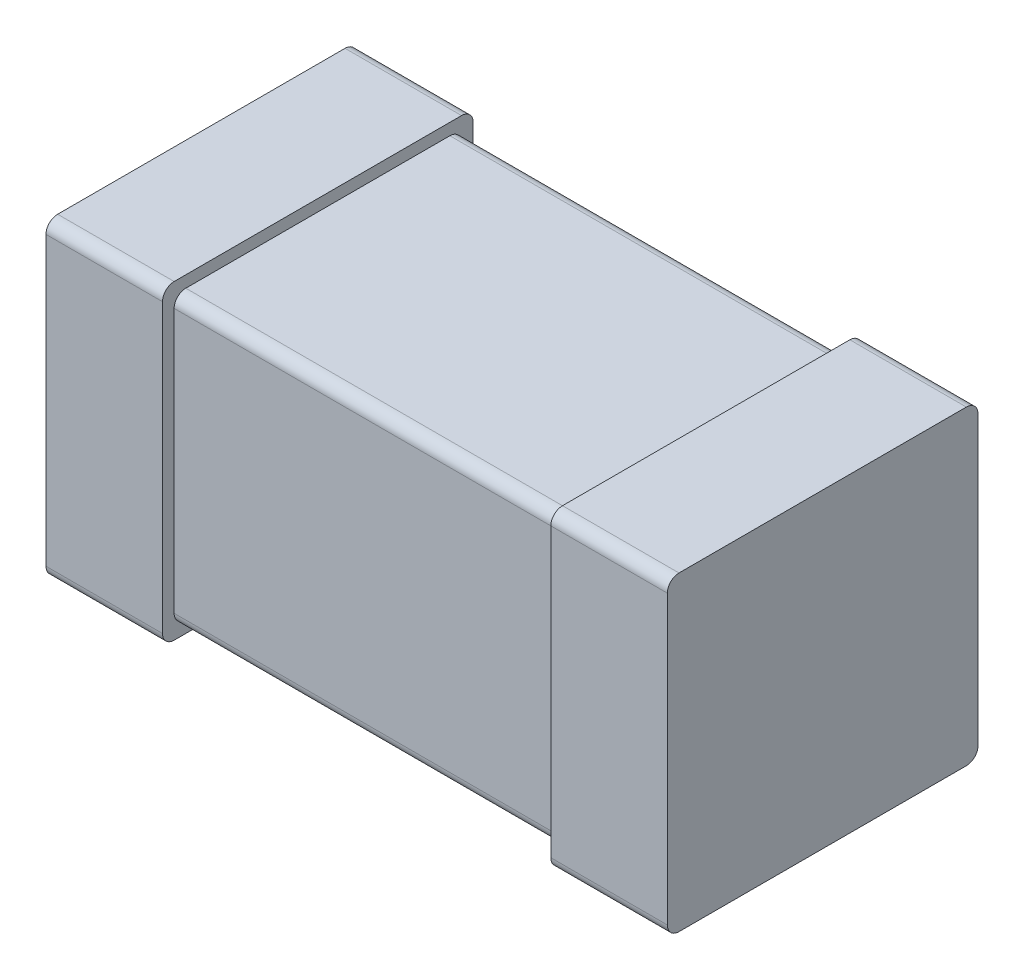
ISO-10303-21;
HEADER;
FILE_DESCRIPTION(('STEP AP214'),'2;1');
FILE_NAME('part.step','',(''),(''),'','','');
FILE_SCHEMA(('AUTOMOTIVE_DESIGN { 1 0 10303 214 1 1 1 1 }'));
ENDSEC;
DATA;
#1=APPLICATION_CONTEXT('core data for automotive mechanical design processes');
#2=APPLICATION_PROTOCOL_DEFINITION('international standard','automotive_design',2000,#1);
#3=PRODUCT_CONTEXT('',#1,'mechanical');
#4=PRODUCT('Part','Part','',(#3));
#5=PRODUCT_RELATED_PRODUCT_CATEGORY('part','',(#4));
#6=PRODUCT_DEFINITION_FORMATION('','',#4);
#7=PRODUCT_DEFINITION_CONTEXT('part definition',#1,'design');
#8=PRODUCT_DEFINITION('design','',#6,#7);
#9=PRODUCT_DEFINITION_SHAPE('','',#8);
#10=(LENGTH_UNIT() NAMED_UNIT(*) SI_UNIT(.MILLI.,.METRE.));
#11=(NAMED_UNIT(*) PLANE_ANGLE_UNIT() SI_UNIT($,.RADIAN.));
#12=(NAMED_UNIT(*) SI_UNIT($,.STERADIAN.) SOLID_ANGLE_UNIT());
#13=UNCERTAINTY_MEASURE_WITH_UNIT(LENGTH_MEASURE(1.E-05),#10,'distance_accuracy_value','');
#14=(GEOMETRIC_REPRESENTATION_CONTEXT(3) GLOBAL_UNCERTAINTY_ASSIGNED_CONTEXT((#13)) GLOBAL_UNIT_ASSIGNED_CONTEXT((#10,
#11,#12)) REPRESENTATION_CONTEXT('',''));
#15=CARTESIAN_POINT('',(0.,0.,0.));
#16=DIRECTION('',(0.,0.,1.));
#17=DIRECTION('',(1.,0.,0.));
#18=AXIS2_PLACEMENT_3D('',#15,#16,#17);
#19=CARTESIAN_POINT('',(190.136744279938,106.76404329235,112.211582908599));
#20=DIRECTION('',(-1.,0.,0.));
#21=DIRECTION('',(0.,0.,1.));
#22=AXIS2_PLACEMENT_3D('',#19,#20,#21);
#23=PLANE('',#22);
#24=DIRECTION('',(0.,0.,1.));
#25=VECTOR('',#24,1.);
#26=CARTESIAN_POINT('',(190.136744279938,106.76404329235,112.211582908599));
#27=LINE('',#26,#25);
#28=CARTESIAN_POINT('',(190.136744279938,106.76404329235,112.241582908599));
#29=VERTEX_POINT('',#28);
#30=CARTESIAN_POINT('',(190.136744279938,106.76404329235,112.981582908599));
#31=VERTEX_POINT('',#30);
#32=EDGE_CURVE('E67',#29,#31,#27,.T.);
#33=ORIENTED_EDGE('',*,*,#32,.F.);
#34=CARTESIAN_POINT('',(190.136744279938,106.73404329235,112.241582908599));
#35=DIRECTION('',(-1.,0.,0.));
#36=DIRECTION('',(0.,0.,1.));
#37=AXIS2_PLACEMENT_3D('',#34,#35,#36);
#38=CIRCLE('',#37,0.0300000000000023);
#39=CARTESIAN_POINT('',(190.136744279938,106.73404329235,112.211582908599));
#40=VERTEX_POINT('',#39);
#41=EDGE_CURVE('E11',#29,#40,#38,.T.);
#42=ORIENTED_EDGE('',*,*,#41,.T.);
#43=DIRECTION('',(0.,-1.,0.));
#44=VECTOR('',#43,1.);
#45=CARTESIAN_POINT('',(190.136744279938,106.76404329235,112.211582908599));
#46=LINE('',#45,#44);
#47=CARTESIAN_POINT('',(190.136744279938,105.99404329235,112.211582908599));
#48=VERTEX_POINT('',#47);
#49=EDGE_CURVE('E55',#40,#48,#46,.T.);
#50=ORIENTED_EDGE('',*,*,#49,.T.);
#51=CARTESIAN_POINT('',(190.136744279938,105.99404329235,112.241582908599));
#52=DIRECTION('',(1.,0.,0.));
#53=DIRECTION('',(0.,0.,1.));
#54=AXIS2_PLACEMENT_3D('',#51,#52,#53);
#55=CIRCLE('',#54,0.0300000000000023);
#56=CARTESIAN_POINT('',(190.136744279938,105.96404329235,112.241582908599));
#57=VERTEX_POINT('',#56);
#58=EDGE_CURVE('E348',#57,#48,#55,.T.);
#59=ORIENTED_EDGE('',*,*,#58,.F.);
#60=DIRECTION('',(0.,0.,1.));
#61=VECTOR('',#60,1.);
#62=CARTESIAN_POINT('',(190.136744279938,105.96404329235,112.211582908599));
#63=LINE('',#62,#61);
#64=CARTESIAN_POINT('',(190.136744279938,105.96404329235,112.981582908599));
#65=VERTEX_POINT('',#64);
#66=EDGE_CURVE('E485',#57,#65,#63,.T.);
#67=ORIENTED_EDGE('',*,*,#66,.T.);
#68=CARTESIAN_POINT('',(190.136744279938,105.99404329235,112.981582908599));
#69=DIRECTION('',(-1.,0.,0.));
#70=DIRECTION('',(0.,0.,1.));
#71=AXIS2_PLACEMENT_3D('',#68,#69,#70);
#72=CIRCLE('',#71,0.0300000000000023);
#73=CARTESIAN_POINT('',(190.136744279938,105.99404329235,113.011582908599));
#74=VERTEX_POINT('',#73);
#75=EDGE_CURVE('E465',#65,#74,#72,.T.);
#76=ORIENTED_EDGE('',*,*,#75,.T.);
#77=DIRECTION('',(0.,-1.,0.));
#78=VECTOR('',#77,1.);
#79=CARTESIAN_POINT('',(190.136744279938,106.76404329235,113.011582908599));
#80=LINE('',#79,#78);
#81=CARTESIAN_POINT('',(190.136744279938,106.73404329235,113.011582908599));
#82=VERTEX_POINT('',#81);
#83=EDGE_CURVE('E349',#82,#74,#80,.T.);
#84=ORIENTED_EDGE('',*,*,#83,.F.);
#85=CARTESIAN_POINT('',(190.136744279938,106.73404329235,112.981582908599));
#86=DIRECTION('',(1.,0.,0.));
#87=DIRECTION('',(0.,0.,1.));
#88=AXIS2_PLACEMENT_3D('',#85,#86,#87);
#89=CIRCLE('',#88,0.0300000000000023);
#90=EDGE_CURVE('E356',#31,#82,#89,.T.);
#91=ORIENTED_EDGE('',*,*,#90,.F.);
#92=EDGE_LOOP('',(#33,#42,#50,#59,#67,#76,#84,#91));
#93=FACE_BOUND('',#92,.T.);
#94=ADVANCED_FACE('F44',(#93),#23,.T.);
#95=CARTESIAN_POINT('',(190.436744279938,105.96404329235,112.211582908599));
#96=DIRECTION('',(0.,-1.,0.));
#97=DIRECTION('',(0.,0.,-1.));
#98=AXIS2_PLACEMENT_3D('',#95,#96,#97);
#99=PLANE('',#98);
#100=ORIENTED_EDGE('',*,*,#66,.F.);
#101=DIRECTION('',(-1.,0.,0.));
#102=VECTOR('',#101,1.);
#103=CARTESIAN_POINT('',(190.436744279938,105.96404329235,112.241582908599));
#104=LINE('',#103,#102);
#105=CARTESIAN_POINT('',(190.436744279938,105.96404329235,112.241582908599));
#106=VERTEX_POINT('',#105);
#107=EDGE_CURVE('E344',#106,#57,#104,.T.);
#108=ORIENTED_EDGE('',*,*,#107,.F.);
#109=DIRECTION('',(0.,0.,1.));
#110=VECTOR('',#109,1.);
#111=CARTESIAN_POINT('',(190.436744279938,105.96404329235,112.211582908599));
#112=LINE('',#111,#110);
#113=CARTESIAN_POINT('',(190.436744279938,105.96404329235,112.981582908599));
#114=VERTEX_POINT('',#113);
#115=EDGE_CURVE('E461',#106,#114,#112,.T.);
#116=ORIENTED_EDGE('',*,*,#115,.T.);
#117=DIRECTION('',(-1.,0.,0.));
#118=VECTOR('',#117,1.);
#119=CARTESIAN_POINT('',(190.436744279938,105.96404329235,112.981582908599));
#120=LINE('',#119,#118);
#121=EDGE_CURVE('E323',#114,#65,#120,.T.);
#122=ORIENTED_EDGE('',*,*,#121,.T.);
#123=EDGE_LOOP('',(#100,#108,#116,#122));
#124=FACE_BOUND('',#123,.T.);
#125=ADVANCED_FACE('F609',(#124),#99,.T.);
#126=CARTESIAN_POINT('',(190.436744279938,105.99404329235,112.981582908599));
#127=DIRECTION('',(-1.,0.,0.));
#128=DIRECTION('',(0.,-1.,0.));
#129=AXIS2_PLACEMENT_3D('',#126,#127,#128);
#130=CYLINDRICAL_SURFACE('',#129,0.0300000000000023);
#131=CARTESIAN_POINT('',(190.436744279938,105.99404329235,112.981582908599));
#132=DIRECTION('',(-1.,0.,0.));
#133=DIRECTION('',(0.,0.,1.));
#134=AXIS2_PLACEMENT_3D('',#131,#132,#133);
#135=CIRCLE('',#134,0.0300000000000023);
#136=CARTESIAN_POINT('',(190.436744279938,105.99404329235,113.011582908599));
#137=VERTEX_POINT('',#136);
#138=EDGE_CURVE('E319',#114,#137,#135,.T.);
#139=ORIENTED_EDGE('',*,*,#138,.T.);
#140=DIRECTION('',(-1.,0.,0.));
#141=VECTOR('',#140,1.);
#142=CARTESIAN_POINT('',(190.436744279938,105.99404329235,113.011582908599));
#143=LINE('',#142,#141);
#144=EDGE_CURVE('E324',#137,#74,#143,.T.);
#145=ORIENTED_EDGE('',*,*,#144,.T.);
#146=ORIENTED_EDGE('',*,*,#75,.F.);
#147=ORIENTED_EDGE('',*,*,#121,.F.);
#148=EDGE_LOOP('',(#139,#145,#146,#147));
#149=FACE_BOUND('',#148,.T.);
#150=ADVANCED_FACE('F614',(#149),#130,.T.);
#151=CARTESIAN_POINT('',(190.436744279938,105.99404329235,112.241582908599));
#152=DIRECTION('',(-1.,0.,0.));
#153=DIRECTION('',(0.,-1.,0.));
#154=AXIS2_PLACEMENT_3D('',#151,#152,#153);
#155=CYLINDRICAL_SURFACE('',#154,0.0300000000000023);
#156=ORIENTED_EDGE('',*,*,#107,.T.);
#157=ORIENTED_EDGE('',*,*,#58,.T.);
#158=DIRECTION('',(-1.,0.,0.));
#159=VECTOR('',#158,1.);
#160=CARTESIAN_POINT('',(190.436744279938,105.99404329235,112.211582908599));
#161=LINE('',#160,#159);
#162=CARTESIAN_POINT('',(190.436744279938,105.99404329235,112.211582908599));
#163=VERTEX_POINT('',#162);
#164=EDGE_CURVE('E294',#163,#48,#161,.T.);
#165=ORIENTED_EDGE('',*,*,#164,.F.);
#166=CARTESIAN_POINT('',(190.436744279938,105.99404329235,112.241582908599));
#167=DIRECTION('',(1.,0.,0.));
#168=DIRECTION('',(0.,0.,1.));
#169=AXIS2_PLACEMENT_3D('',#166,#167,#168);
#170=CIRCLE('',#169,0.0300000000000023);
#171=EDGE_CURVE('E419',#106,#163,#170,.T.);
#172=ORIENTED_EDGE('',*,*,#171,.F.);
#173=EDGE_LOOP('',(#156,#157,#165,#172));
#174=FACE_BOUND('',#173,.T.);
#175=ADVANCED_FACE('F633',(#174),#155,.T.);
#176=CARTESIAN_POINT('',(190.436744279938,106.76404329235,113.011582908599));
#177=DIRECTION('',(0.,0.,1.));
#178=DIRECTION('',(1.,0.,0.));
#179=AXIS2_PLACEMENT_3D('',#176,#177,#178);
#180=PLANE('',#179);
#181=DIRECTION('',(0.,-1.,0.));
#182=VECTOR('',#181,1.);
#183=CARTESIAN_POINT('',(190.436744279938,106.76404329235,113.011582908599));
#184=LINE('',#183,#182);
#185=CARTESIAN_POINT('',(190.436744279938,106.73404329235,113.011582908599));
#186=VERTEX_POINT('',#185);
#187=EDGE_CURVE('E414',#186,#137,#184,.T.);
#188=ORIENTED_EDGE('',*,*,#187,.F.);
#189=DIRECTION('',(-1.,0.,0.));
#190=VECTOR('',#189,1.);
#191=CARTESIAN_POINT('',(190.436744279938,106.73404329235,113.011582908599));
#192=LINE('',#191,#190);
#193=EDGE_CURVE('E352',#186,#82,#192,.T.);
#194=ORIENTED_EDGE('',*,*,#193,.T.);
#195=ORIENTED_EDGE('',*,*,#83,.T.);
#196=ORIENTED_EDGE('',*,*,#144,.F.);
#197=EDGE_LOOP('',(#188,#194,#195,#196));
#198=FACE_BOUND('',#197,.T.);
#199=ADVANCED_FACE('F517',(#198),#180,.T.);
#200=CARTESIAN_POINT('',(190.436744279938,106.76404329235,112.211582908599));
#201=DIRECTION('',(0.,0.,1.));
#202=DIRECTION('',(1.,0.,0.));
#203=AXIS2_PLACEMENT_3D('',#200,#201,#202);
#204=PLANE('',#203);
#205=ORIENTED_EDGE('',*,*,#164,.T.);
#206=ORIENTED_EDGE('',*,*,#49,.F.);
#207=DIRECTION('',(-1.,0.,0.));
#208=VECTOR('',#207,1.);
#209=CARTESIAN_POINT('',(190.436744279938,106.73404329235,112.211582908599));
#210=LINE('',#209,#208);
#211=CARTESIAN_POINT('',(190.436744279938,106.73404329235,112.211582908599));
#212=VERTEX_POINT('',#211);
#213=EDGE_CURVE('E329',#212,#40,#210,.T.);
#214=ORIENTED_EDGE('',*,*,#213,.F.);
#215=DIRECTION('',(0.,-1.,0.));
#216=VECTOR('',#215,1.);
#217=CARTESIAN_POINT('',(190.436744279938,106.76404329235,112.211582908599));
#218=LINE('',#217,#216);
#219=EDGE_CURVE('E291',#212,#163,#218,.T.);
#220=ORIENTED_EDGE('',*,*,#219,.T.);
#221=EDGE_LOOP('',(#205,#206,#214,#220));
#222=FACE_BOUND('',#221,.T.);
#223=ADVANCED_FACE('F625',(#222),#204,.F.);
#224=CARTESIAN_POINT('',(190.436744279938,106.73404329235,112.981582908599));
#225=DIRECTION('',(-1.,0.,0.));
#226=DIRECTION('',(0.,1.,0.));
#227=AXIS2_PLACEMENT_3D('',#224,#225,#226);
#228=CYLINDRICAL_SURFACE('',#227,0.0300000000000023);
#229=DIRECTION('',(-1.,0.,0.));
#230=VECTOR('',#229,1.);
#231=CARTESIAN_POINT('',(190.436744279938,106.76404329235,112.981582908599));
#232=LINE('',#231,#230);
#233=CARTESIAN_POINT('',(190.436744279938,106.76404329235,112.981582908599));
#234=VERTEX_POINT('',#233);
#235=EDGE_CURVE('E295',#234,#31,#232,.T.);
#236=ORIENTED_EDGE('',*,*,#235,.T.);
#237=ORIENTED_EDGE('',*,*,#90,.T.);
#238=ORIENTED_EDGE('',*,*,#193,.F.);
#239=CARTESIAN_POINT('',(190.436744279938,106.73404329235,112.981582908599));
#240=DIRECTION('',(1.,0.,0.));
#241=DIRECTION('',(0.,0.,1.));
#242=AXIS2_PLACEMENT_3D('',#239,#240,#241);
#243=CIRCLE('',#242,0.0300000000000023);
#244=EDGE_CURVE('E418',#234,#186,#243,.T.);
#245=ORIENTED_EDGE('',*,*,#244,.F.);
#246=EDGE_LOOP('',(#236,#237,#238,#245));
#247=FACE_BOUND('',#246,.T.);
#248=ADVANCED_FACE('F510',(#247),#228,.T.);
#249=CARTESIAN_POINT('',(190.436744279938,106.73404329235,112.241582908599));
#250=DIRECTION('',(-1.,0.,0.));
#251=DIRECTION('',(0.,1.,0.));
#252=AXIS2_PLACEMENT_3D('',#249,#250,#251);
#253=CYLINDRICAL_SURFACE('',#252,0.0300000000000023);
#254=CARTESIAN_POINT('',(190.436744279938,106.73404329235,112.241582908599));
#255=DIRECTION('',(-1.,0.,0.));
#256=DIRECTION('',(0.,0.,1.));
#257=AXIS2_PLACEMENT_3D('',#254,#255,#256);
#258=CIRCLE('',#257,0.0300000000000023);
#259=CARTESIAN_POINT('',(190.436744279938,106.76404329235,112.241582908599));
#260=VERTEX_POINT('',#259);
#261=EDGE_CURVE('E383',#260,#212,#258,.T.);
#262=ORIENTED_EDGE('',*,*,#261,.T.);
#263=ORIENTED_EDGE('',*,*,#213,.T.);
#264=ORIENTED_EDGE('',*,*,#41,.F.);
#265=DIRECTION('',(-1.,0.,0.));
#266=VECTOR('',#265,1.);
#267=CARTESIAN_POINT('',(190.436744279938,106.76404329235,112.241582908599));
#268=LINE('',#267,#266);
#269=EDGE_CURVE('E325',#260,#29,#268,.T.);
#270=ORIENTED_EDGE('',*,*,#269,.F.);
#271=EDGE_LOOP('',(#262,#263,#264,#270));
#272=FACE_BOUND('',#271,.T.);
#273=ADVANCED_FACE('F593',(#272),#253,.T.);
#274=CARTESIAN_POINT('',(190.436744279938,106.76404329235,112.211582908599));
#275=DIRECTION('',(0.,-1.,0.));
#276=DIRECTION('',(0.,0.,-1.));
#277=AXIS2_PLACEMENT_3D('',#274,#275,#276);
#278=PLANE('',#277);
#279=ORIENTED_EDGE('',*,*,#235,.F.);
#280=DIRECTION('',(0.,0.,1.));
#281=VECTOR('',#280,1.);
#282=CARTESIAN_POINT('',(190.436744279938,106.76404329235,112.211582908599));
#283=LINE('',#282,#281);
#284=EDGE_CURVE('E360',#260,#234,#283,.T.);
#285=ORIENTED_EDGE('',*,*,#284,.F.);
#286=ORIENTED_EDGE('',*,*,#269,.T.);
#287=ORIENTED_EDGE('',*,*,#32,.T.);
#288=EDGE_LOOP('',(#279,#285,#286,#287));
#289=FACE_BOUND('',#288,.T.);
#290=ADVANCED_FACE('F596',(#289),#278,.F.);
#291=CARTESIAN_POINT('',(190.436744279938,106.76404329235,112.211582908599));
#292=DIRECTION('',(-1.,0.,0.));
#293=DIRECTION('',(0.,0.,1.));
#294=AXIS2_PLACEMENT_3D('',#291,#292,#293);
#295=PLANE('',#294);
#296=ORIENTED_EDGE('',*,*,#244,.T.);
#297=ORIENTED_EDGE('',*,*,#187,.T.);
#298=ORIENTED_EDGE('',*,*,#138,.F.);
#299=ORIENTED_EDGE('',*,*,#115,.F.);
#300=ORIENTED_EDGE('',*,*,#171,.T.);
#301=ORIENTED_EDGE('',*,*,#219,.F.);
#302=ORIENTED_EDGE('',*,*,#261,.F.);
#303=ORIENTED_EDGE('',*,*,#284,.T.);
#304=EDGE_LOOP('',(#296,#297,#298,#299,#300,#301,#302,#303));
#305=FACE_BOUND('',#304,.T.);
#306=DIRECTION('',(0.,-1.,0.));
#307=VECTOR('',#306,1.);
#308=CARTESIAN_POINT('',(190.436744279938,106.73404329235,112.241582908599));
#309=LINE('',#308,#307);
#310=CARTESIAN_POINT('',(190.436744279938,106.70404329235,112.241582908599));
#311=VERTEX_POINT('',#310);
#312=CARTESIAN_POINT('',(190.436744279938,106.02404329235,112.241582908599));
#313=VERTEX_POINT('',#312);
#314=EDGE_CURVE('E357',#311,#313,#309,.T.);
#315=ORIENTED_EDGE('',*,*,#314,.T.);
#316=CARTESIAN_POINT('',(190.436744279938,106.02404329235,112.271582908599));
#317=DIRECTION('',(1.,0.,0.));
#318=DIRECTION('',(0.,0.,1.));
#319=AXIS2_PLACEMENT_3D('',#316,#317,#318);
#320=CIRCLE('',#319,0.0300000000000023);
#321=CARTESIAN_POINT('',(190.436744279938,105.99404329235,112.271582908599));
#322=VERTEX_POINT('',#321);
#323=EDGE_CURVE('E193',#322,#313,#320,.T.);
#324=ORIENTED_EDGE('',*,*,#323,.F.);
#325=DIRECTION('',(0.,0.,1.));
#326=VECTOR('',#325,1.);
#327=CARTESIAN_POINT('',(190.436744279938,105.99404329235,112.241582908599));
#328=LINE('',#327,#326);
#329=CARTESIAN_POINT('',(190.436744279938,105.99404329235,112.951582908599));
#330=VERTEX_POINT('',#329);
#331=EDGE_CURVE('E317',#322,#330,#328,.T.);
#332=ORIENTED_EDGE('',*,*,#331,.T.);
#333=CARTESIAN_POINT('',(190.436744279938,106.02404329235,112.951582908599));
#334=DIRECTION('',(-1.,0.,0.));
#335=DIRECTION('',(0.,0.,1.));
#336=AXIS2_PLACEMENT_3D('',#333,#334,#335);
#337=CIRCLE('',#336,0.0300000000000023);
#338=CARTESIAN_POINT('',(190.436744279938,106.02404329235,112.981582908599));
#339=VERTEX_POINT('',#338);
#340=EDGE_CURVE('E181',#330,#339,#337,.T.);
#341=ORIENTED_EDGE('',*,*,#340,.T.);
#342=DIRECTION('',(0.,-1.,0.));
#343=VECTOR('',#342,1.);
#344=CARTESIAN_POINT('',(190.436744279938,106.73404329235,112.981582908599));
#345=LINE('',#344,#343);
#346=CARTESIAN_POINT('',(190.436744279938,106.70404329235,112.981582908599));
#347=VERTEX_POINT('',#346);
#348=EDGE_CURVE('E427',#347,#339,#345,.T.);
#349=ORIENTED_EDGE('',*,*,#348,.F.);
#350=CARTESIAN_POINT('',(190.436744279938,106.70404329235,112.951582908599));
#351=DIRECTION('',(1.,0.,0.));
#352=DIRECTION('',(0.,0.,1.));
#353=AXIS2_PLACEMENT_3D('',#350,#351,#352);
#354=CIRCLE('',#353,0.0300000000000023);
#355=CARTESIAN_POINT('',(190.436744279938,106.73404329235,112.951582908599));
#356=VERTEX_POINT('',#355);
#357=EDGE_CURVE('E335',#356,#347,#354,.T.);
#358=ORIENTED_EDGE('',*,*,#357,.F.);
#359=DIRECTION('',(0.,0.,1.));
#360=VECTOR('',#359,1.);
#361=CARTESIAN_POINT('',(190.436744279938,106.73404329235,112.241582908599));
#362=LINE('',#361,#360);
#363=CARTESIAN_POINT('',(190.436744279938,106.73404329235,112.271582908599));
#364=VERTEX_POINT('',#363);
#365=EDGE_CURVE('E334',#364,#356,#362,.T.);
#366=ORIENTED_EDGE('',*,*,#365,.F.);
#367=CARTESIAN_POINT('',(190.436744279938,106.70404329235,112.271582908599));
#368=DIRECTION('',(-1.,0.,0.));
#369=DIRECTION('',(0.,0.,1.));
#370=AXIS2_PLACEMENT_3D('',#367,#368,#369);
#371=CIRCLE('',#370,0.0300000000000023);
#372=EDGE_CURVE('E318',#364,#311,#371,.T.);
#373=ORIENTED_EDGE('',*,*,#372,.T.);
#374=EDGE_LOOP('',(#315,#324,#332,#341,#349,#358,#366,#373));
#375=FACE_BOUND('',#374,.T.);
#376=ADVANCED_FACE('F520',(#305,#375),#295,.F.);
#377=CARTESIAN_POINT('',(191.436744279938,106.73404329235,112.241582908599));
#378=DIRECTION('',(0.,-1.,0.));
#379=DIRECTION('',(0.,0.,-1.));
#380=AXIS2_PLACEMENT_3D('',#377,#378,#379);
#381=PLANE('',#380);
#382=DIRECTION('',(-1.,0.,0.));
#383=VECTOR('',#382,1.);
#384=CARTESIAN_POINT('',(191.436744279938,106.73404329235,112.951582908599));
#385=LINE('',#384,#383);
#386=CARTESIAN_POINT('',(191.436744279938,106.73404329235,112.951582908599));
#387=VERTEX_POINT('',#386);
#388=EDGE_CURVE('E330',#387,#356,#385,.T.);
#389=ORIENTED_EDGE('',*,*,#388,.F.);
#390=DIRECTION('',(0.,0.,1.));
#391=VECTOR('',#390,1.);
#392=CARTESIAN_POINT('',(191.436744279938,106.73404329235,112.241582908599));
#393=LINE('',#392,#391);
#394=CARTESIAN_POINT('',(191.436744279938,106.73404329235,112.271582908599));
#395=VERTEX_POINT('',#394);
#396=EDGE_CURVE('E411',#395,#387,#393,.T.);
#397=ORIENTED_EDGE('',*,*,#396,.F.);
#398=DIRECTION('',(-1.,0.,0.));
#399=VECTOR('',#398,1.);
#400=CARTESIAN_POINT('',(191.436744279938,106.73404329235,112.271582908599));
#401=LINE('',#400,#399);
#402=EDGE_CURVE('E370',#395,#364,#401,.T.);
#403=ORIENTED_EDGE('',*,*,#402,.T.);
#404=ORIENTED_EDGE('',*,*,#365,.T.);
#405=EDGE_LOOP('',(#389,#397,#403,#404));
#406=FACE_BOUND('',#405,.T.);
#407=ADVANCED_FACE('F603',(#406),#381,.F.);
#408=CARTESIAN_POINT('',(191.436744279938,106.70404329235,112.951582908599));
#409=DIRECTION('',(-1.,0.,0.));
#410=DIRECTION('',(0.,1.,0.));
#411=AXIS2_PLACEMENT_3D('',#408,#409,#410);
#412=CYLINDRICAL_SURFACE('',#411,0.0300000000000023);
#413=ORIENTED_EDGE('',*,*,#388,.T.);
#414=ORIENTED_EDGE('',*,*,#357,.T.);
#415=DIRECTION('',(-1.,0.,0.));
#416=VECTOR('',#415,1.);
#417=CARTESIAN_POINT('',(191.436744279938,106.70404329235,112.981582908599));
#418=LINE('',#417,#416);
#419=CARTESIAN_POINT('',(191.436744279938,106.70404329235,112.981582908599));
#420=VERTEX_POINT('',#419);
#421=EDGE_CURVE('E48',#420,#347,#418,.T.);
#422=ORIENTED_EDGE('',*,*,#421,.F.);
#423=CARTESIAN_POINT('',(191.436744279938,106.70404329235,112.951582908599));
#424=DIRECTION('',(1.,0.,0.));
#425=DIRECTION('',(0.,0.,1.));
#426=AXIS2_PLACEMENT_3D('',#423,#424,#425);
#427=CIRCLE('',#426,0.0300000000000023);
#428=EDGE_CURVE('E366',#387,#420,#427,.T.);
#429=ORIENTED_EDGE('',*,*,#428,.F.);
#430=EDGE_LOOP('',(#413,#414,#422,#429));
#431=FACE_BOUND('',#430,.T.);
#432=ADVANCED_FACE('F629',(#431),#412,.T.);
#433=CARTESIAN_POINT('',(191.436744279938,106.73404329235,112.981582908599));
#434=DIRECTION('',(0.,0.,1.));
#435=DIRECTION('',(1.,0.,0.));
#436=AXIS2_PLACEMENT_3D('',#433,#434,#435);
#437=PLANE('',#436);
#438=DIRECTION('',(0.,-1.,0.));
#439=VECTOR('',#438,1.);
#440=CARTESIAN_POINT('',(191.436744279938,106.73404329235,112.981582908599));
#441=LINE('',#440,#439);
#442=CARTESIAN_POINT('',(191.436744279938,106.02404329235,112.981582908599));
#443=VERTEX_POINT('',#442);
#444=EDGE_CURVE('E307',#420,#443,#441,.T.);
#445=ORIENTED_EDGE('',*,*,#444,.F.);
#446=ORIENTED_EDGE('',*,*,#421,.T.);
#447=ORIENTED_EDGE('',*,*,#348,.T.);
#448=DIRECTION('',(-1.,0.,0.));
#449=VECTOR('',#448,1.);
#450=CARTESIAN_POINT('',(191.436744279938,106.02404329235,112.981582908599));
#451=LINE('',#450,#449);
#452=EDGE_CURVE('E313',#443,#339,#451,.T.);
#453=ORIENTED_EDGE('',*,*,#452,.F.);
#454=EDGE_LOOP('',(#445,#446,#447,#453));
#455=FACE_BOUND('',#454,.T.);
#456=ADVANCED_FACE('F619',(#455),#437,.T.);
#457=CARTESIAN_POINT('',(191.436744279938,106.02404329235,112.951582908599));
#458=DIRECTION('',(-1.,0.,0.));
#459=DIRECTION('',(0.,-1.,0.));
#460=AXIS2_PLACEMENT_3D('',#457,#458,#459);
#461=CYLINDRICAL_SURFACE('',#460,0.0300000000000023);
#462=CARTESIAN_POINT('',(191.436744279938,106.02404329235,112.951582908599));
#463=DIRECTION('',(-1.,0.,0.));
#464=DIRECTION('',(0.,0.,1.));
#465=AXIS2_PLACEMENT_3D('',#462,#463,#464);
#466=CIRCLE('',#465,0.0300000000000023);
#467=CARTESIAN_POINT('',(191.436744279938,105.99404329235,112.951582908599));
#468=VERTEX_POINT('',#467);
#469=EDGE_CURVE('E338',#468,#443,#466,.T.);
#470=ORIENTED_EDGE('',*,*,#469,.T.);
#471=ORIENTED_EDGE('',*,*,#452,.T.);
#472=ORIENTED_EDGE('',*,*,#340,.F.);
#473=DIRECTION('',(-1.,0.,0.));
#474=VECTOR('',#473,1.);
#475=CARTESIAN_POINT('',(191.436744279938,105.99404329235,112.951582908599));
#476=LINE('',#475,#474);
#477=EDGE_CURVE('E314',#468,#330,#476,.T.);
#478=ORIENTED_EDGE('',*,*,#477,.F.);
#479=EDGE_LOOP('',(#470,#471,#472,#478));
#480=FACE_BOUND('',#479,.T.);
#481=ADVANCED_FACE('F436',(#480),#461,.T.);
#482=CARTESIAN_POINT('',(191.436744279938,105.99404329235,112.241582908599));
#483=DIRECTION('',(0.,-1.,0.));
#484=DIRECTION('',(0.,0.,-1.));
#485=AXIS2_PLACEMENT_3D('',#482,#483,#484);
#486=PLANE('',#485);
#487=ORIENTED_EDGE('',*,*,#331,.F.);
#488=DIRECTION('',(-1.,0.,0.));
#489=VECTOR('',#488,1.);
#490=CARTESIAN_POINT('',(191.436744279938,105.99404329235,112.271582908599));
#491=LINE('',#490,#489);
#492=CARTESIAN_POINT('',(191.436744279938,105.99404329235,112.271582908599));
#493=VERTEX_POINT('',#492);
#494=EDGE_CURVE('E426',#493,#322,#491,.T.);
#495=ORIENTED_EDGE('',*,*,#494,.F.);
#496=DIRECTION('',(0.,0.,1.));
#497=VECTOR('',#496,1.);
#498=CARTESIAN_POINT('',(191.436744279938,105.99404329235,112.241582908599));
#499=LINE('',#498,#497);
#500=EDGE_CURVE('E309',#493,#468,#499,.T.);
#501=ORIENTED_EDGE('',*,*,#500,.T.);
#502=ORIENTED_EDGE('',*,*,#477,.T.);
#503=EDGE_LOOP('',(#487,#495,#501,#502));
#504=FACE_BOUND('',#503,.T.);
#505=ADVANCED_FACE('F444',(#504),#486,.T.);
#506=CARTESIAN_POINT('',(191.436744279938,106.02404329235,112.271582908599));
#507=DIRECTION('',(-1.,0.,0.));
#508=DIRECTION('',(0.,-1.,0.));
#509=AXIS2_PLACEMENT_3D('',#506,#507,#508);
#510=CYLINDRICAL_SURFACE('',#509,0.0300000000000023);
#511=ORIENTED_EDGE('',*,*,#494,.T.);
#512=ORIENTED_EDGE('',*,*,#323,.T.);
#513=DIRECTION('',(-1.,0.,0.));
#514=VECTOR('',#513,1.);
#515=CARTESIAN_POINT('',(191.436744279938,106.02404329235,112.241582908599));
#516=LINE('',#515,#514);
#517=CARTESIAN_POINT('',(191.436744279938,106.02404329235,112.241582908599));
#518=VERTEX_POINT('',#517);
#519=EDGE_CURVE('E391',#518,#313,#516,.T.);
#520=ORIENTED_EDGE('',*,*,#519,.F.);
#521=CARTESIAN_POINT('',(191.436744279938,106.02404329235,112.271582908599));
#522=DIRECTION('',(1.,0.,0.));
#523=DIRECTION('',(0.,0.,1.));
#524=AXIS2_PLACEMENT_3D('',#521,#522,#523);
#525=CIRCLE('',#524,0.0300000000000023);
#526=EDGE_CURVE('E304',#493,#518,#525,.T.);
#527=ORIENTED_EDGE('',*,*,#526,.F.);
#528=EDGE_LOOP('',(#511,#512,#520,#527));
#529=FACE_BOUND('',#528,.T.);
#530=ADVANCED_FACE('F730',(#529),#510,.T.);
#531=CARTESIAN_POINT('',(191.436744279938,106.73404329235,112.241582908599));
#532=DIRECTION('',(0.,0.,1.));
#533=DIRECTION('',(1.,0.,0.));
#534=AXIS2_PLACEMENT_3D('',#531,#532,#533);
#535=PLANE('',#534);
#536=ORIENTED_EDGE('',*,*,#519,.T.);
#537=ORIENTED_EDGE('',*,*,#314,.F.);
#538=DIRECTION('',(-1.,0.,0.));
#539=VECTOR('',#538,1.);
#540=CARTESIAN_POINT('',(191.436744279938,106.70404329235,112.241582908599));
#541=LINE('',#540,#539);
#542=CARTESIAN_POINT('',(191.436744279938,106.70404329235,112.241582908599));
#543=VERTEX_POINT('',#542);
#544=EDGE_CURVE('E339',#543,#311,#541,.T.);
#545=ORIENTED_EDGE('',*,*,#544,.F.);
#546=DIRECTION('',(0.,-1.,0.));
#547=VECTOR('',#546,1.);
#548=CARTESIAN_POINT('',(191.436744279938,106.73404329235,112.241582908599));
#549=LINE('',#548,#547);
#550=EDGE_CURVE('E388',#543,#518,#549,.T.);
#551=ORIENTED_EDGE('',*,*,#550,.T.);
#552=EDGE_LOOP('',(#536,#537,#545,#551));
#553=FACE_BOUND('',#552,.T.);
#554=ADVANCED_FACE('F654',(#553),#535,.F.);
#555=CARTESIAN_POINT('',(191.436744279938,106.70404329235,112.271582908599));
#556=DIRECTION('',(-1.,0.,0.));
#557=DIRECTION('',(0.,1.,0.));
#558=AXIS2_PLACEMENT_3D('',#555,#556,#557);
#559=CYLINDRICAL_SURFACE('',#558,0.0300000000000023);
#560=CARTESIAN_POINT('',(191.436744279938,106.70404329235,112.271582908599));
#561=DIRECTION('',(-1.,0.,0.));
#562=DIRECTION('',(0.,0.,1.));
#563=AXIS2_PLACEMENT_3D('',#560,#561,#562);
#564=CIRCLE('',#563,0.0300000000000023);
#565=EDGE_CURVE('E343',#395,#543,#564,.T.);
#566=ORIENTED_EDGE('',*,*,#565,.T.);
#567=ORIENTED_EDGE('',*,*,#544,.T.);
#568=ORIENTED_EDGE('',*,*,#372,.F.);
#569=ORIENTED_EDGE('',*,*,#402,.F.);
#570=EDGE_LOOP('',(#566,#567,#568,#569));
#571=FACE_BOUND('',#570,.T.);
#572=ADVANCED_FACE('F46',(#571),#559,.T.);
#573=CARTESIAN_POINT('',(191.436744279938,106.76404329235,112.211582908599));
#574=DIRECTION('',(-1.,0.,0.));
#575=DIRECTION('',(0.,0.,1.));
#576=AXIS2_PLACEMENT_3D('',#573,#574,#575);
#577=PLANE('',#576);
#578=DIRECTION('',(0.,0.,1.));
#579=VECTOR('',#578,1.);
#580=CARTESIAN_POINT('',(191.436744279938,106.76404329235,112.211582908599));
#581=LINE('',#580,#579);
#582=CARTESIAN_POINT('',(191.436744279938,106.76404329235,112.241582908599));
#583=VERTEX_POINT('',#582);
#584=CARTESIAN_POINT('',(191.436744279938,106.76404329235,112.981582908599));
#585=VERTEX_POINT('',#584);
#586=EDGE_CURVE('E261',#583,#585,#581,.T.);
#587=ORIENTED_EDGE('',*,*,#586,.F.);
#588=CARTESIAN_POINT('',(191.436744279938,106.73404329235,112.241582908599));
#589=DIRECTION('',(-1.,0.,0.));
#590=DIRECTION('',(0.,0.,1.));
#591=AXIS2_PLACEMENT_3D('',#588,#589,#590);
#592=CIRCLE('',#591,0.0300000000000023);
#593=CARTESIAN_POINT('',(191.436744279938,106.73404329235,112.211582908599));
#594=VERTEX_POINT('',#593);
#595=EDGE_CURVE('E256',#583,#594,#592,.T.);
#596=ORIENTED_EDGE('',*,*,#595,.T.);
#597=DIRECTION('',(0.,-1.,0.));
#598=VECTOR('',#597,1.);
#599=CARTESIAN_POINT('',(191.436744279938,106.76404329235,112.211582908599));
#600=LINE('',#599,#598);
#601=CARTESIAN_POINT('',(191.436744279938,105.99404329235,112.211582908599));
#602=VERTEX_POINT('',#601);
#603=EDGE_CURVE('E422',#594,#602,#600,.T.);
#604=ORIENTED_EDGE('',*,*,#603,.T.);
#605=CARTESIAN_POINT('',(191.436744279938,105.99404329235,112.241582908599));
#606=DIRECTION('',(1.,0.,0.));
#607=DIRECTION('',(0.,0.,1.));
#608=AXIS2_PLACEMENT_3D('',#605,#606,#607);
#609=CIRCLE('',#608,0.0300000000000023);
#610=CARTESIAN_POINT('',(191.436744279938,105.96404329235,112.241582908599));
#611=VERTEX_POINT('',#610);
#612=EDGE_CURVE('E457',#611,#602,#609,.T.);
#613=ORIENTED_EDGE('',*,*,#612,.F.);
#614=DIRECTION('',(0.,0.,1.));
#615=VECTOR('',#614,1.);
#616=CARTESIAN_POINT('',(191.436744279938,105.96404329235,112.211582908599));
#617=LINE('',#616,#615);
#618=CARTESIAN_POINT('',(191.436744279938,105.96404329235,112.981582908599));
#619=VERTEX_POINT('',#618);
#620=EDGE_CURVE('E500',#611,#619,#617,.T.);
#621=ORIENTED_EDGE('',*,*,#620,.T.);
#622=CARTESIAN_POINT('',(191.436744279938,105.99404329235,112.981582908599));
#623=DIRECTION('',(-1.,0.,0.));
#624=DIRECTION('',(0.,0.,1.));
#625=AXIS2_PLACEMENT_3D('',#622,#623,#624);
#626=CIRCLE('',#625,0.0300000000000023);
#627=CARTESIAN_POINT('',(191.436744279938,105.99404329235,113.011582908599));
#628=VERTEX_POINT('',#627);
#629=EDGE_CURVE('E413',#619,#628,#626,.T.);
#630=ORIENTED_EDGE('',*,*,#629,.T.);
#631=DIRECTION('',(0.,-1.,0.));
#632=VECTOR('',#631,1.);
#633=CARTESIAN_POINT('',(191.436744279938,106.76404329235,113.011582908599));
#634=LINE('',#633,#632);
#635=CARTESIAN_POINT('',(191.436744279938,106.73404329235,113.011582908599));
#636=VERTEX_POINT('',#635);
#637=EDGE_CURVE('E303',#636,#628,#634,.T.);
#638=ORIENTED_EDGE('',*,*,#637,.F.);
#639=CARTESIAN_POINT('',(191.436744279938,106.73404329235,112.981582908599));
#640=DIRECTION('',(1.,0.,0.));
#641=DIRECTION('',(0.,0.,1.));
#642=AXIS2_PLACEMENT_3D('',#639,#640,#641);
#643=CIRCLE('',#642,0.0300000000000023);
#644=EDGE_CURVE('E273',#585,#636,#643,.T.);
#645=ORIENTED_EDGE('',*,*,#644,.F.);
#646=EDGE_LOOP('',(#587,#596,#604,#613,#621,#630,#638,#645));
#647=FACE_BOUND('',#646,.T.);
#648=ORIENTED_EDGE('',*,*,#565,.F.);
#649=ORIENTED_EDGE('',*,*,#396,.T.);
#650=ORIENTED_EDGE('',*,*,#428,.T.);
#651=ORIENTED_EDGE('',*,*,#444,.T.);
#652=ORIENTED_EDGE('',*,*,#469,.F.);
#653=ORIENTED_EDGE('',*,*,#500,.F.);
#654=ORIENTED_EDGE('',*,*,#526,.T.);
#655=ORIENTED_EDGE('',*,*,#550,.F.);
#656=EDGE_LOOP('',(#648,#649,#650,#651,#652,#653,#654,#655));
#657=FACE_BOUND('',#656,.T.);
#658=ADVANCED_FACE('F440',(#647,#657),#577,.T.);
#659=CARTESIAN_POINT('',(191.736744279938,105.96404329235,112.211582908599));
#660=DIRECTION('',(0.,-1.,0.));
#661=DIRECTION('',(0.,0.,-1.));
#662=AXIS2_PLACEMENT_3D('',#659,#660,#661);
#663=PLANE('',#662);
#664=ORIENTED_EDGE('',*,*,#620,.F.);
#665=DIRECTION('',(-1.,0.,0.));
#666=VECTOR('',#665,1.);
#667=CARTESIAN_POINT('',(191.736744279938,105.96404329235,112.241582908599));
#668=LINE('',#667,#666);
#669=CARTESIAN_POINT('',(191.736744279938,105.96404329235,112.241582908599));
#670=VERTEX_POINT('',#669);
#671=EDGE_CURVE('E379',#670,#611,#668,.T.);
#672=ORIENTED_EDGE('',*,*,#671,.F.);
#673=DIRECTION('',(0.,0.,1.));
#674=VECTOR('',#673,1.);
#675=CARTESIAN_POINT('',(191.736744279938,105.96404329235,112.211582908599));
#676=LINE('',#675,#674);
#677=CARTESIAN_POINT('',(191.736744279938,105.96404329235,112.981582908599));
#678=VERTEX_POINT('',#677);
#679=EDGE_CURVE('E308',#670,#678,#676,.T.);
#680=ORIENTED_EDGE('',*,*,#679,.T.);
#681=DIRECTION('',(-1.,0.,0.));
#682=VECTOR('',#681,1.);
#683=CARTESIAN_POINT('',(191.736744279938,105.96404329235,112.981582908599));
#684=LINE('',#683,#682);
#685=EDGE_CURVE('E540',#678,#619,#684,.T.);
#686=ORIENTED_EDGE('',*,*,#685,.T.);
#687=EDGE_LOOP('',(#664,#672,#680,#686));
#688=FACE_BOUND('',#687,.T.);
#689=ADVANCED_FACE('F575',(#688),#663,.T.);
#690=CARTESIAN_POINT('',(191.736744279938,105.99404329235,112.981582908599));
#691=DIRECTION('',(-1.,0.,0.));
#692=DIRECTION('',(0.,-1.,0.));
#693=AXIS2_PLACEMENT_3D('',#690,#691,#692);
#694=CYLINDRICAL_SURFACE('',#693,0.0300000000000023);
#695=CARTESIAN_POINT('',(191.736744279938,105.99404329235,112.981582908599));
#696=DIRECTION('',(-1.,0.,0.));
#697=DIRECTION('',(0.,0.,1.));
#698=AXIS2_PLACEMENT_3D('',#695,#696,#697);
#699=CIRCLE('',#698,0.0300000000000023);
#700=CARTESIAN_POINT('',(191.736744279938,105.99404329235,113.011582908599));
#701=VERTEX_POINT('',#700);
#702=EDGE_CURVE('E378',#678,#701,#699,.T.);
#703=ORIENTED_EDGE('',*,*,#702,.T.);
#704=DIRECTION('',(-1.,0.,0.));
#705=VECTOR('',#704,1.);
#706=CARTESIAN_POINT('',(191.736744279938,105.99404329235,113.011582908599));
#707=LINE('',#706,#705);
#708=EDGE_CURVE('E374',#701,#628,#707,.T.);
#709=ORIENTED_EDGE('',*,*,#708,.T.);
#710=ORIENTED_EDGE('',*,*,#629,.F.);
#711=ORIENTED_EDGE('',*,*,#685,.F.);
#712=EDGE_LOOP('',(#703,#709,#710,#711));
#713=FACE_BOUND('',#712,.T.);
#714=ADVANCED_FACE('F562',(#713),#694,.T.);
#715=CARTESIAN_POINT('',(191.736744279938,105.99404329235,112.241582908599));
#716=DIRECTION('',(-1.,0.,0.));
#717=DIRECTION('',(0.,-1.,0.));
#718=AXIS2_PLACEMENT_3D('',#715,#716,#717);
#719=CYLINDRICAL_SURFACE('',#718,0.0300000000000023);
#720=ORIENTED_EDGE('',*,*,#671,.T.);
#721=ORIENTED_EDGE('',*,*,#612,.T.);
#722=DIRECTION('',(-1.,0.,0.));
#723=VECTOR('',#722,1.);
#724=CARTESIAN_POINT('',(191.736744279938,105.99404329235,112.211582908599));
#725=LINE('',#724,#723);
#726=CARTESIAN_POINT('',(191.736744279938,105.99404329235,112.211582908599));
#727=VERTEX_POINT('',#726);
#728=EDGE_CURVE('E299',#727,#602,#725,.T.);
#729=ORIENTED_EDGE('',*,*,#728,.F.);
#730=CARTESIAN_POINT('',(191.736744279938,105.99404329235,112.241582908599));
#731=DIRECTION('',(1.,0.,0.));
#732=DIRECTION('',(0.,0.,1.));
#733=AXIS2_PLACEMENT_3D('',#730,#731,#732);
#734=CIRCLE('',#733,0.0300000000000023);
#735=EDGE_CURVE('E280',#670,#727,#734,.T.);
#736=ORIENTED_EDGE('',*,*,#735,.F.);
#737=EDGE_LOOP('',(#720,#721,#729,#736));
#738=FACE_BOUND('',#737,.T.);
#739=ADVANCED_FACE('F580',(#738),#719,.T.);
#740=CARTESIAN_POINT('',(191.736744279938,106.76404329235,113.011582908599));
#741=DIRECTION('',(0.,0.,1.));
#742=DIRECTION('',(1.,0.,0.));
#743=AXIS2_PLACEMENT_3D('',#740,#741,#742);
#744=PLANE('',#743);
#745=DIRECTION('',(0.,-1.,0.));
#746=VECTOR('',#745,1.);
#747=CARTESIAN_POINT('',(191.736744279938,106.76404329235,113.011582908599));
#748=LINE('',#747,#746);
#749=CARTESIAN_POINT('',(191.736744279938,106.73404329235,113.011582908599));
#750=VERTEX_POINT('',#749);
#751=EDGE_CURVE('E286',#750,#701,#748,.T.);
#752=ORIENTED_EDGE('',*,*,#751,.F.);
#753=DIRECTION('',(-1.,0.,0.));
#754=VECTOR('',#753,1.);
#755=CARTESIAN_POINT('',(191.736744279938,106.73404329235,113.011582908599));
#756=LINE('',#755,#754);
#757=EDGE_CURVE('E460',#750,#636,#756,.T.);
#758=ORIENTED_EDGE('',*,*,#757,.T.);
#759=ORIENTED_EDGE('',*,*,#637,.T.);
#760=ORIENTED_EDGE('',*,*,#708,.F.);
#761=EDGE_LOOP('',(#752,#758,#759,#760));
#762=FACE_BOUND('',#761,.T.);
#763=ADVANCED_FACE('F566',(#762),#744,.T.);
#764=CARTESIAN_POINT('',(191.736744279938,106.76404329235,112.211582908599));
#765=DIRECTION('',(0.,0.,1.));
#766=DIRECTION('',(1.,0.,0.));
#767=AXIS2_PLACEMENT_3D('',#764,#765,#766);
#768=PLANE('',#767);
#769=ORIENTED_EDGE('',*,*,#728,.T.);
#770=ORIENTED_EDGE('',*,*,#603,.F.);
#771=DIRECTION('',(-1.,0.,0.));
#772=VECTOR('',#771,1.);
#773=CARTESIAN_POINT('',(191.736744279938,106.73404329235,112.211582908599));
#774=LINE('',#773,#772);
#775=CARTESIAN_POINT('',(191.736744279938,106.73404329235,112.211582908599));
#776=VERTEX_POINT('',#775);
#777=EDGE_CURVE('E260',#776,#594,#774,.T.);
#778=ORIENTED_EDGE('',*,*,#777,.F.);
#779=DIRECTION('',(0.,-1.,0.));
#780=VECTOR('',#779,1.);
#781=CARTESIAN_POINT('',(191.736744279938,106.76404329235,112.211582908599));
#782=LINE('',#781,#780);
#783=EDGE_CURVE('E271',#776,#727,#782,.T.);
#784=ORIENTED_EDGE('',*,*,#783,.T.);
#785=EDGE_LOOP('',(#769,#770,#778,#784));
#786=FACE_BOUND('',#785,.T.);
#787=ADVANCED_FACE('F637',(#786),#768,.F.);
#788=CARTESIAN_POINT('',(191.736744279938,106.73404329235,112.981582908599));
#789=DIRECTION('',(-1.,0.,0.));
#790=DIRECTION('',(0.,1.,0.));
#791=AXIS2_PLACEMENT_3D('',#788,#789,#790);
#792=CYLINDRICAL_SURFACE('',#791,0.0300000000000023);
#793=DIRECTION('',(-1.,0.,0.));
#794=VECTOR('',#793,1.);
#795=CARTESIAN_POINT('',(191.736744279938,106.76404329235,112.981582908599));
#796=LINE('',#795,#794);
#797=CARTESIAN_POINT('',(191.736744279938,106.76404329235,112.981582908599));
#798=VERTEX_POINT('',#797);
#799=EDGE_CURVE('E278',#798,#585,#796,.T.);
#800=ORIENTED_EDGE('',*,*,#799,.T.);
#801=ORIENTED_EDGE('',*,*,#644,.T.);
#802=ORIENTED_EDGE('',*,*,#757,.F.);
#803=CARTESIAN_POINT('',(191.736744279938,106.73404329235,112.981582908599));
#804=DIRECTION('',(1.,0.,0.));
#805=DIRECTION('',(0.,0.,1.));
#806=AXIS2_PLACEMENT_3D('',#803,#804,#805);
#807=CIRCLE('',#806,0.0300000000000023);
#808=EDGE_CURVE('E296',#798,#750,#807,.T.);
#809=ORIENTED_EDGE('',*,*,#808,.F.);
#810=EDGE_LOOP('',(#800,#801,#802,#809));
#811=FACE_BOUND('',#810,.T.);
#812=ADVANCED_FACE('F568',(#811),#792,.T.);
#813=CARTESIAN_POINT('',(191.736744279938,106.73404329235,112.241582908599));
#814=DIRECTION('',(-1.,0.,0.));
#815=DIRECTION('',(0.,1.,0.));
#816=AXIS2_PLACEMENT_3D('',#813,#814,#815);
#817=CYLINDRICAL_SURFACE('',#816,0.0300000000000023);
#818=CARTESIAN_POINT('',(191.736744279938,106.73404329235,112.241582908599));
#819=DIRECTION('',(-1.,0.,0.));
#820=DIRECTION('',(0.,0.,1.));
#821=AXIS2_PLACEMENT_3D('',#818,#819,#820);
#822=CIRCLE('',#821,0.0300000000000023);
#823=CARTESIAN_POINT('',(191.736744279938,106.76404329235,112.241582908599));
#824=VERTEX_POINT('',#823);
#825=EDGE_CURVE('E254',#824,#776,#822,.T.);
#826=ORIENTED_EDGE('',*,*,#825,.T.);
#827=ORIENTED_EDGE('',*,*,#777,.T.);
#828=ORIENTED_EDGE('',*,*,#595,.F.);
#829=DIRECTION('',(-1.,0.,0.));
#830=VECTOR('',#829,1.);
#831=CARTESIAN_POINT('',(191.736744279938,106.76404329235,112.241582908599));
#832=LINE('',#831,#830);
#833=EDGE_CURVE('E250',#824,#583,#832,.T.);
#834=ORIENTED_EDGE('',*,*,#833,.F.);
#835=EDGE_LOOP('',(#826,#827,#828,#834));
#836=FACE_BOUND('',#835,.T.);
#837=ADVANCED_FACE('F252',(#836),#817,.T.);
#838=CARTESIAN_POINT('',(191.736744279938,106.76404329235,112.211582908599));
#839=DIRECTION('',(0.,-1.,0.));
#840=DIRECTION('',(0.,0.,-1.));
#841=AXIS2_PLACEMENT_3D('',#838,#839,#840);
#842=PLANE('',#841);
#843=ORIENTED_EDGE('',*,*,#799,.F.);
#844=DIRECTION('',(0.,0.,1.));
#845=VECTOR('',#844,1.);
#846=CARTESIAN_POINT('',(191.736744279938,106.76404329235,112.211582908599));
#847=LINE('',#846,#845);
#848=EDGE_CURVE('E268',#824,#798,#847,.T.);
#849=ORIENTED_EDGE('',*,*,#848,.F.);
#850=ORIENTED_EDGE('',*,*,#833,.T.);
#851=ORIENTED_EDGE('',*,*,#586,.T.);
#852=EDGE_LOOP('',(#843,#849,#850,#851));
#853=FACE_BOUND('',#852,.T.);
#854=ADVANCED_FACE('F276',(#853),#842,.F.);
#855=CARTESIAN_POINT('',(191.736744279938,106.76404329235,112.211582908599));
#856=DIRECTION('',(-1.,0.,0.));
#857=DIRECTION('',(0.,0.,1.));
#858=AXIS2_PLACEMENT_3D('',#855,#856,#857);
#859=PLANE('',#858);
#860=ORIENTED_EDGE('',*,*,#808,.T.);
#861=ORIENTED_EDGE('',*,*,#751,.T.);
#862=ORIENTED_EDGE('',*,*,#702,.F.);
#863=ORIENTED_EDGE('',*,*,#679,.F.);
#864=ORIENTED_EDGE('',*,*,#735,.T.);
#865=ORIENTED_EDGE('',*,*,#783,.F.);
#866=ORIENTED_EDGE('',*,*,#825,.F.);
#867=ORIENTED_EDGE('',*,*,#848,.T.);
#868=EDGE_LOOP('',(#860,#861,#862,#863,#864,#865,#866,#867));
#869=FACE_BOUND('',#868,.T.);
#870=ADVANCED_FACE('F267',(#869),#859,.F.);
#871=CLOSED_SHELL('',(#94,#125,#150,#175,#199,#223,#248,#273,#290,#376,#407,#432,#456,#481,#505,
#530,#554,#572,#658,#689,#714,#739,#763,#787,#812,#837,#854,#870));
#872=MANIFOLD_SOLID_BREP('B2',#871);
#873=ADVANCED_BREP_SHAPE_REPRESENTATION('',(#18,#872),#14);
#874=SHAPE_DEFINITION_REPRESENTATION(#9,#873);
ENDSEC;
END-ISO-10303-21;
